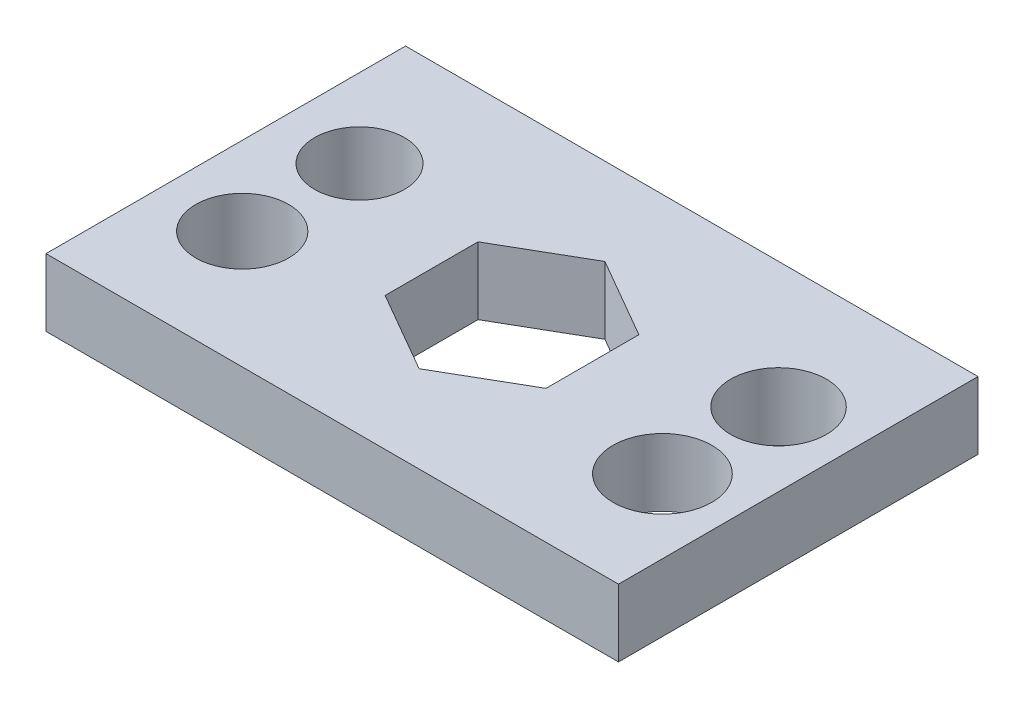
ISO-10303-21;
HEADER;
FILE_DESCRIPTION(('STEP AP214'),'2;1');
FILE_NAME('part.step','',(''),(''),'','','');
FILE_SCHEMA(('AUTOMOTIVE_DESIGN { 1 0 10303 214 1 1 1 1 }'));
ENDSEC;
DATA;
#1=APPLICATION_CONTEXT('core data for automotive mechanical design processes');
#2=APPLICATION_PROTOCOL_DEFINITION('international standard','automotive_design',2000,#1);
#3=PRODUCT_CONTEXT('',#1,'mechanical');
#4=PRODUCT('Part','Part','',(#3));
#5=PRODUCT_RELATED_PRODUCT_CATEGORY('part','',(#4));
#6=PRODUCT_DEFINITION_FORMATION('','',#4);
#7=PRODUCT_DEFINITION_CONTEXT('part definition',#1,'design');
#8=PRODUCT_DEFINITION('design','',#6,#7);
#9=PRODUCT_DEFINITION_SHAPE('','',#8);
#10=(LENGTH_UNIT() NAMED_UNIT(*) SI_UNIT(.MILLI.,.METRE.));
#11=(NAMED_UNIT(*) PLANE_ANGLE_UNIT() SI_UNIT($,.RADIAN.));
#12=(NAMED_UNIT(*) SI_UNIT($,.STERADIAN.) SOLID_ANGLE_UNIT());
#13=UNCERTAINTY_MEASURE_WITH_UNIT(LENGTH_MEASURE(1.E-05),#10,'distance_accuracy_value','');
#14=(GEOMETRIC_REPRESENTATION_CONTEXT(3) GLOBAL_UNCERTAINTY_ASSIGNED_CONTEXT((#13)) GLOBAL_UNIT_ASSIGNED_CONTEXT((#10,
#11,#12)) REPRESENTATION_CONTEXT('',''));
#15=CARTESIAN_POINT('',(0.,0.,0.));
#16=DIRECTION('',(0.,0.,1.));
#17=DIRECTION('',(1.,0.,0.));
#18=AXIS2_PLACEMENT_3D('',#15,#16,#17);
#19=CARTESIAN_POINT('',(0.,2.25,0.));
#20=DIRECTION('',(0.,-1.,0.));
#21=DIRECTION('',(0.,0.,-1.));
#22=AXIS2_PLACEMENT_3D('',#19,#20,#21);
#23=PLANE('',#22);
#24=DIRECTION('',(0.,0.,-1.));
#25=VECTOR('',#24,1.);
#26=CARTESIAN_POINT('',(9.55341392062965,2.25,6.));
#27=LINE('',#26,#25);
#28=CARTESIAN_POINT('',(9.55341392062965,2.25,6.));
#29=VERTEX_POINT('',#28);
#30=CARTESIAN_POINT('',(9.55341392062965,2.25,-6.));
#31=VERTEX_POINT('',#30);
#32=EDGE_CURVE('E168',#29,#31,#27,.T.);
#33=ORIENTED_EDGE('',*,*,#32,.T.);
#34=DIRECTION('',(-1.,0.,0.));
#35=VECTOR('',#34,1.);
#36=CARTESIAN_POINT('',(-9.55341392062965,2.25,-6.));
#37=LINE('',#36,#35);
#38=CARTESIAN_POINT('',(-9.55341392062965,2.25,-6.));
#39=VERTEX_POINT('',#38);
#40=EDGE_CURVE('E171',#31,#39,#37,.T.);
#41=ORIENTED_EDGE('',*,*,#40,.T.);
#42=DIRECTION('',(0.,0.,1.));
#43=VECTOR('',#42,1.);
#44=CARTESIAN_POINT('',(-9.55341392062965,2.25,6.));
#45=LINE('',#44,#43);
#46=CARTESIAN_POINT('',(-9.55341392062965,2.25,6.));
#47=VERTEX_POINT('',#46);
#48=EDGE_CURVE('E174',#39,#47,#45,.T.);
#49=ORIENTED_EDGE('',*,*,#48,.T.);
#50=DIRECTION('',(1.,0.,0.));
#51=VECTOR('',#50,1.);
#52=CARTESIAN_POINT('',(-9.55341392062965,2.25,6.));
#53=LINE('',#52,#51);
#54=EDGE_CURVE('E176',#47,#29,#53,.T.);
#55=ORIENTED_EDGE('',*,*,#54,.T.);
#56=EDGE_LOOP('',(#33,#41,#49,#55));
#57=FACE_BOUND('',#56,.T.);
#58=DIRECTION('',(0.,0.,-1.));
#59=VECTOR('',#58,1.);
#60=CARTESIAN_POINT('',(2.685,2.25,1.55018547277415));
#61=LINE('',#60,#59);
#62=CARTESIAN_POINT('',(2.685,2.25,1.55018547277415));
#63=VERTEX_POINT('',#62);
#64=CARTESIAN_POINT('',(2.685,2.25,-1.55018547277415));
#65=VERTEX_POINT('',#64);
#66=EDGE_CURVE('E114',#63,#65,#61,.T.);
#67=ORIENTED_EDGE('',*,*,#66,.F.);
#68=DIRECTION('',(0.866025403784439,0.,-0.5));
#69=VECTOR('',#68,1.);
#70=CARTESIAN_POINT('',(0.,2.25,3.10037094554829));
#71=LINE('',#70,#69);
#72=CARTESIAN_POINT('',(0.,2.25,3.10037094554829));
#73=VERTEX_POINT('',#72);
#74=EDGE_CURVE('E145',#73,#63,#71,.T.);
#75=ORIENTED_EDGE('',*,*,#74,.F.);
#76=DIRECTION('',(0.866025403784439,0.,0.5));
#77=VECTOR('',#76,1.);
#78=CARTESIAN_POINT('',(-2.685,2.25,1.55018547277414));
#79=LINE('',#78,#77);
#80=CARTESIAN_POINT('',(-2.685,2.25,1.55018547277414));
#81=VERTEX_POINT('',#80);
#82=EDGE_CURVE('E143',#81,#73,#79,.T.);
#83=ORIENTED_EDGE('',*,*,#82,.F.);
#84=DIRECTION('',(0.,0.,1.));
#85=VECTOR('',#84,1.);
#86=CARTESIAN_POINT('',(-2.685,2.25,-1.55018547277415));
#87=LINE('',#86,#85);
#88=CARTESIAN_POINT('',(-2.685,2.25,-1.55018547277415));
#89=VERTEX_POINT('',#88);
#90=EDGE_CURVE('E138',#89,#81,#87,.T.);
#91=ORIENTED_EDGE('',*,*,#90,.F.);
#92=DIRECTION('',(-0.866025403784439,0.,0.5));
#93=VECTOR('',#92,1.);
#94=CARTESIAN_POINT('',(0.,2.25,-3.10037094554829));
#95=LINE('',#94,#93);
#96=CARTESIAN_POINT('',(0.,2.25,-3.10037094554829));
#97=VERTEX_POINT('',#96);
#98=EDGE_CURVE('E136',#97,#89,#95,.T.);
#99=ORIENTED_EDGE('',*,*,#98,.F.);
#100=DIRECTION('',(-0.866025403784438,0.,-0.5));
#101=VECTOR('',#100,1.);
#102=CARTESIAN_POINT('',(2.685,2.25,-1.55018547277415));
#103=LINE('',#102,#101);
#104=EDGE_CURVE('E122',#65,#97,#103,.T.);
#105=ORIENTED_EDGE('',*,*,#104,.F.);
#106=EDGE_LOOP('',(#67,#75,#83,#91,#99,#105));
#107=FACE_BOUND('',#106,.T.);
#108=CARTESIAN_POINT('',(-6.92575523116967,2.25,-1.836983108));
#109=DIRECTION('',(0.,1.,0.));
#110=DIRECTION('',(0.,0.,1.));
#111=AXIS2_PLACEMENT_3D('',#108,#109,#110);
#112=CIRCLE('',#111,1.5);
#113=CARTESIAN_POINT('',(-6.92575523116967,2.25,-0.336983108000004));
#114=VERTEX_POINT('',#113);
#115=EDGE_CURVE('E148',#114,#114,#112,.T.);
#116=ORIENTED_EDGE('',*,*,#115,.F.);
#117=EDGE_LOOP('',(#116));
#118=FACE_BOUND('',#117,.T.);
#119=CARTESIAN_POINT('',(7.09887872713484,2.25,-1.79730386713403));
#120=DIRECTION('',(0.,1.,0.));
#121=DIRECTION('',(0.,0.,1.));
#122=AXIS2_PLACEMENT_3D('',#119,#120,#121);
#123=CIRCLE('',#122,1.6);
#124=CARTESIAN_POINT('',(7.09887872713484,2.25,-0.197303867134024));
#125=VERTEX_POINT('',#124);
#126=EDGE_CURVE('E288',#125,#125,#123,.T.);
#127=ORIENTED_EDGE('',*,*,#126,.F.);
#128=EDGE_LOOP('',(#127));
#129=FACE_BOUND('',#128,.T.);
#130=CARTESIAN_POINT('',(7.09887872713484,2.25,2.07793010147465));
#131=DIRECTION('',(0.,1.,0.));
#132=DIRECTION('',(0.,0.,1.));
#133=AXIS2_PLACEMENT_3D('',#130,#131,#132);
#134=CIRCLE('',#133,1.65);
#135=CARTESIAN_POINT('',(7.09887872713484,2.25,3.72793010147465));
#136=VERTEX_POINT('',#135);
#137=EDGE_CURVE('E282',#136,#136,#134,.T.);
#138=ORIENTED_EDGE('',*,*,#137,.F.);
#139=EDGE_LOOP('',(#138));
#140=FACE_BOUND('',#139,.T.);
#141=CARTESIAN_POINT('',(-6.92575523116967,2.25,2.07793010147465));
#142=DIRECTION('',(0.,1.,0.));
#143=DIRECTION('',(0.,0.,1.));
#144=AXIS2_PLACEMENT_3D('',#141,#142,#143);
#145=CIRCLE('',#144,1.55);
#146=CARTESIAN_POINT('',(-6.92575523116967,2.25,3.62793010147465));
#147=VERTEX_POINT('',#146);
#148=EDGE_CURVE('E273',#147,#147,#145,.T.);
#149=ORIENTED_EDGE('',*,*,#148,.F.);
#150=EDGE_LOOP('',(#149));
#151=FACE_BOUND('',#150,.T.);
#152=ADVANCED_FACE('F37',(#57,#107,#118,#129,#140,#151),#23,.F.);
#153=CARTESIAN_POINT('',(0.,0.,0.));
#154=DIRECTION('',(0.,-1.,0.));
#155=DIRECTION('',(0.,0.,-1.));
#156=AXIS2_PLACEMENT_3D('',#153,#154,#155);
#157=PLANE('',#156);
#158=CARTESIAN_POINT('',(7.09887872713484,0.,2.07793010147465));
#159=DIRECTION('',(0.,1.,0.));
#160=DIRECTION('',(0.,0.,1.));
#161=AXIS2_PLACEMENT_3D('',#158,#159,#160);
#162=CIRCLE('',#161,1.65);
#163=CARTESIAN_POINT('',(7.09887872713484,0.,3.72793010147465));
#164=VERTEX_POINT('',#163);
#165=EDGE_CURVE('E279',#164,#164,#162,.T.);
#166=ORIENTED_EDGE('',*,*,#165,.T.);
#167=EDGE_LOOP('',(#166));
#168=FACE_BOUND('',#167,.T.);
#169=CARTESIAN_POINT('',(-6.92575523116967,0.,-1.836983108));
#170=DIRECTION('',(0.,1.,0.));
#171=DIRECTION('',(0.,0.,1.));
#172=AXIS2_PLACEMENT_3D('',#169,#170,#171);
#173=CIRCLE('',#172,1.5);
#174=CARTESIAN_POINT('',(-6.92575523116967,0.,-0.336983108000004));
#175=VERTEX_POINT('',#174);
#176=EDGE_CURVE('E291',#175,#175,#173,.T.);
#177=ORIENTED_EDGE('',*,*,#176,.T.);
#178=EDGE_LOOP('',(#177));
#179=FACE_BOUND('',#178,.T.);
#180=DIRECTION('',(0.,0.,-1.));
#181=VECTOR('',#180,1.);
#182=CARTESIAN_POINT('',(9.55341392062965,0.,6.));
#183=LINE('',#182,#181);
#184=CARTESIAN_POINT('',(9.55341392062965,0.,6.));
#185=VERTEX_POINT('',#184);
#186=CARTESIAN_POINT('',(9.55341392062965,0.,-6.));
#187=VERTEX_POINT('',#186);
#188=EDGE_CURVE('E130',#185,#187,#183,.T.);
#189=ORIENTED_EDGE('',*,*,#188,.F.);
#190=DIRECTION('',(1.,0.,0.));
#191=VECTOR('',#190,1.);
#192=CARTESIAN_POINT('',(-9.55341392062965,0.,6.));
#193=LINE('',#192,#191);
#194=CARTESIAN_POINT('',(-9.55341392062965,0.,6.));
#195=VERTEX_POINT('',#194);
#196=EDGE_CURVE('E172',#195,#185,#193,.T.);
#197=ORIENTED_EDGE('',*,*,#196,.F.);
#198=DIRECTION('',(0.,0.,1.));
#199=VECTOR('',#198,1.);
#200=CARTESIAN_POINT('',(-9.55341392062965,0.,6.));
#201=LINE('',#200,#199);
#202=CARTESIAN_POINT('',(-9.55341392062965,0.,-6.));
#203=VERTEX_POINT('',#202);
#204=EDGE_CURVE('E183',#203,#195,#201,.T.);
#205=ORIENTED_EDGE('',*,*,#204,.F.);
#206=DIRECTION('',(-1.,0.,0.));
#207=VECTOR('',#206,1.);
#208=CARTESIAN_POINT('',(-9.55341392062965,0.,-6.));
#209=LINE('',#208,#207);
#210=EDGE_CURVE('E181',#187,#203,#209,.T.);
#211=ORIENTED_EDGE('',*,*,#210,.F.);
#212=EDGE_LOOP('',(#189,#197,#205,#211));
#213=FACE_BOUND('',#212,.T.);
#214=DIRECTION('',(0.866025403784439,0.,-0.5));
#215=VECTOR('',#214,1.);
#216=CARTESIAN_POINT('',(0.,0.,3.10037094554829));
#217=LINE('',#216,#215);
#218=CARTESIAN_POINT('',(0.,0.,3.10037094554829));
#219=VERTEX_POINT('',#218);
#220=CARTESIAN_POINT('',(2.685,0.,1.55018547277415));
#221=VERTEX_POINT('',#220);
#222=EDGE_CURVE('E123',#219,#221,#217,.T.);
#223=ORIENTED_EDGE('',*,*,#222,.T.);
#224=DIRECTION('',(0.,0.,-1.));
#225=VECTOR('',#224,1.);
#226=CARTESIAN_POINT('',(2.685,0.,1.55018547277415));
#227=LINE('',#226,#225);
#228=CARTESIAN_POINT('',(2.685,0.,-1.55018547277415));
#229=VERTEX_POINT('',#228);
#230=EDGE_CURVE('E60',#221,#229,#227,.T.);
#231=ORIENTED_EDGE('',*,*,#230,.T.);
#232=DIRECTION('',(-0.866025403784438,0.,-0.5));
#233=VECTOR('',#232,1.);
#234=CARTESIAN_POINT('',(2.685,0.,-1.55018547277415));
#235=LINE('',#234,#233);
#236=CARTESIAN_POINT('',(0.,0.,-3.10037094554829));
#237=VERTEX_POINT('',#236);
#238=EDGE_CURVE('E129',#229,#237,#235,.T.);
#239=ORIENTED_EDGE('',*,*,#238,.T.);
#240=DIRECTION('',(-0.866025403784439,0.,0.5));
#241=VECTOR('',#240,1.);
#242=CARTESIAN_POINT('',(0.,0.,-3.10037094554829));
#243=LINE('',#242,#241);
#244=CARTESIAN_POINT('',(-2.685,0.,-1.55018547277415));
#245=VERTEX_POINT('',#244);
#246=EDGE_CURVE('E150',#237,#245,#243,.T.);
#247=ORIENTED_EDGE('',*,*,#246,.T.);
#248=DIRECTION('',(0.,0.,1.));
#249=VECTOR('',#248,1.);
#250=CARTESIAN_POINT('',(-2.685,0.,-1.55018547277415));
#251=LINE('',#250,#249);
#252=CARTESIAN_POINT('',(-2.685,0.,1.55018547277414));
#253=VERTEX_POINT('',#252);
#254=EDGE_CURVE('E153',#245,#253,#251,.T.);
#255=ORIENTED_EDGE('',*,*,#254,.T.);
#256=DIRECTION('',(0.866025403784439,0.,0.5));
#257=VECTOR('',#256,1.);
#258=CARTESIAN_POINT('',(-2.685,0.,1.55018547277414));
#259=LINE('',#258,#257);
#260=EDGE_CURVE('E156',#253,#219,#259,.T.);
#261=ORIENTED_EDGE('',*,*,#260,.T.);
#262=EDGE_LOOP('',(#223,#231,#239,#247,#255,#261));
#263=FACE_BOUND('',#262,.T.);
#264=CARTESIAN_POINT('',(7.09887872713484,0.,-1.79730386713403));
#265=DIRECTION('',(0.,1.,0.));
#266=DIRECTION('',(0.,0.,1.));
#267=AXIS2_PLACEMENT_3D('',#264,#265,#266);
#268=CIRCLE('',#267,1.6);
#269=CARTESIAN_POINT('',(7.09887872713484,0.,-0.197303867134024));
#270=VERTEX_POINT('',#269);
#271=EDGE_CURVE('E285',#270,#270,#268,.T.);
#272=ORIENTED_EDGE('',*,*,#271,.T.);
#273=EDGE_LOOP('',(#272));
#274=FACE_BOUND('',#273,.T.);
#275=CARTESIAN_POINT('',(-6.92575523116967,0.,2.07793010147465));
#276=DIRECTION('',(0.,1.,0.));
#277=DIRECTION('',(0.,0.,1.));
#278=AXIS2_PLACEMENT_3D('',#275,#276,#277);
#279=CIRCLE('',#278,1.55);
#280=CARTESIAN_POINT('',(-6.92575523116967,0.,3.62793010147465));
#281=VERTEX_POINT('',#280);
#282=EDGE_CURVE('E276',#281,#281,#279,.T.);
#283=ORIENTED_EDGE('',*,*,#282,.T.);
#284=EDGE_LOOP('',(#283));
#285=FACE_BOUND('',#284,.T.);
#286=ADVANCED_FACE('F201',(#168,#179,#213,#263,#274,#285),#157,.T.);
#287=CARTESIAN_POINT('',(9.55341392062965,2.25,6.));
#288=DIRECTION('',(-1.,0.,0.));
#289=DIRECTION('',(0.,0.,1.));
#290=AXIS2_PLACEMENT_3D('',#287,#288,#289);
#291=PLANE('',#290);
#292=ORIENTED_EDGE('',*,*,#188,.T.);
#293=DIRECTION('',(0.,-1.,0.));
#294=VECTOR('',#293,1.);
#295=CARTESIAN_POINT('',(9.55341392062965,2.25,-6.));
#296=LINE('',#295,#294);
#297=EDGE_CURVE('E11',#31,#187,#296,.T.);
#298=ORIENTED_EDGE('',*,*,#297,.F.);
#299=ORIENTED_EDGE('',*,*,#32,.F.);
#300=DIRECTION('',(0.,-1.,0.));
#301=VECTOR('',#300,1.);
#302=CARTESIAN_POINT('',(9.55341392062965,2.25,6.));
#303=LINE('',#302,#301);
#304=EDGE_CURVE('E178',#29,#185,#303,.T.);
#305=ORIENTED_EDGE('',*,*,#304,.T.);
#306=EDGE_LOOP('',(#292,#298,#299,#305));
#307=FACE_BOUND('',#306,.T.);
#308=ADVANCED_FACE('F39',(#307),#291,.F.);
#309=CARTESIAN_POINT('',(-9.55341392062965,2.25,-6.));
#310=DIRECTION('',(0.,0.,1.));
#311=DIRECTION('',(1.,0.,0.));
#312=AXIS2_PLACEMENT_3D('',#309,#310,#311);
#313=PLANE('',#312);
#314=ORIENTED_EDGE('',*,*,#210,.T.);
#315=DIRECTION('',(0.,-1.,0.));
#316=VECTOR('',#315,1.);
#317=CARTESIAN_POINT('',(-9.55341392062965,2.25,-6.));
#318=LINE('',#317,#316);
#319=EDGE_CURVE('E45',#39,#203,#318,.T.);
#320=ORIENTED_EDGE('',*,*,#319,.F.);
#321=ORIENTED_EDGE('',*,*,#40,.F.);
#322=ORIENTED_EDGE('',*,*,#297,.T.);
#323=EDGE_LOOP('',(#314,#320,#321,#322));
#324=FACE_BOUND('',#323,.T.);
#325=ADVANCED_FACE('F211',(#324),#313,.F.);
#326=CARTESIAN_POINT('',(-9.55341392062965,2.25,6.));
#327=DIRECTION('',(1.,0.,0.));
#328=DIRECTION('',(0.,0.,-1.));
#329=AXIS2_PLACEMENT_3D('',#326,#327,#328);
#330=PLANE('',#329);
#331=ORIENTED_EDGE('',*,*,#204,.T.);
#332=DIRECTION('',(0.,-1.,0.));
#333=VECTOR('',#332,1.);
#334=CARTESIAN_POINT('',(-9.55341392062965,2.25,6.));
#335=LINE('',#334,#333);
#336=EDGE_CURVE('E188',#47,#195,#335,.T.);
#337=ORIENTED_EDGE('',*,*,#336,.F.);
#338=ORIENTED_EDGE('',*,*,#48,.F.);
#339=ORIENTED_EDGE('',*,*,#319,.T.);
#340=EDGE_LOOP('',(#331,#337,#338,#339));
#341=FACE_BOUND('',#340,.T.);
#342=ADVANCED_FACE('F195',(#341),#330,.F.);
#343=CARTESIAN_POINT('',(-9.55341392062965,2.25,6.));
#344=DIRECTION('',(0.,0.,-1.));
#345=DIRECTION('',(-1.,0.,0.));
#346=AXIS2_PLACEMENT_3D('',#343,#344,#345);
#347=PLANE('',#346);
#348=ORIENTED_EDGE('',*,*,#196,.T.);
#349=ORIENTED_EDGE('',*,*,#304,.F.);
#350=ORIENTED_EDGE('',*,*,#54,.F.);
#351=ORIENTED_EDGE('',*,*,#336,.T.);
#352=EDGE_LOOP('',(#348,#349,#350,#351));
#353=FACE_BOUND('',#352,.T.);
#354=ADVANCED_FACE('F205',(#353),#347,.F.);
#355=CARTESIAN_POINT('',(2.685,2.25,1.55018547277415));
#356=DIRECTION('',(-1.,0.,0.));
#357=DIRECTION('',(0.,0.,1.));
#358=AXIS2_PLACEMENT_3D('',#355,#356,#357);
#359=PLANE('',#358);
#360=ORIENTED_EDGE('',*,*,#230,.F.);
#361=DIRECTION('',(0.,-1.,0.));
#362=VECTOR('',#361,1.);
#363=CARTESIAN_POINT('',(2.685,2.25,1.55018547277415));
#364=LINE('',#363,#362);
#365=EDGE_CURVE('E118',#63,#221,#364,.T.);
#366=ORIENTED_EDGE('',*,*,#365,.F.);
#367=ORIENTED_EDGE('',*,*,#66,.T.);
#368=DIRECTION('',(0.,-1.,0.));
#369=VECTOR('',#368,1.);
#370=CARTESIAN_POINT('',(2.685,2.25,-1.55018547277415));
#371=LINE('',#370,#369);
#372=EDGE_CURVE('E117',#65,#229,#371,.T.);
#373=ORIENTED_EDGE('',*,*,#372,.T.);
#374=EDGE_LOOP('',(#360,#366,#367,#373));
#375=FACE_BOUND('',#374,.T.);
#376=ADVANCED_FACE('F116',(#375),#359,.T.);
#377=CARTESIAN_POINT('',(2.685,2.25,-1.55018547277415));
#378=DIRECTION('',(-0.5,0.,0.866025403784438));
#379=DIRECTION('',(0.866025403784439,0.,0.5));
#380=AXIS2_PLACEMENT_3D('',#377,#378,#379);
#381=PLANE('',#380);
#382=ORIENTED_EDGE('',*,*,#238,.F.);
#383=ORIENTED_EDGE('',*,*,#372,.F.);
#384=ORIENTED_EDGE('',*,*,#104,.T.);
#385=DIRECTION('',(0.,-1.,0.));
#386=VECTOR('',#385,1.);
#387=CARTESIAN_POINT('',(0.,2.25,-3.10037094554829));
#388=LINE('',#387,#386);
#389=EDGE_CURVE('E131',#97,#237,#388,.T.);
#390=ORIENTED_EDGE('',*,*,#389,.T.);
#391=EDGE_LOOP('',(#382,#383,#384,#390));
#392=FACE_BOUND('',#391,.T.);
#393=ADVANCED_FACE('F126',(#392),#381,.T.);
#394=CARTESIAN_POINT('',(0.,2.25,-3.10037094554829));
#395=DIRECTION('',(0.5,0.,0.866025403784439));
#396=DIRECTION('',(0.866025403784439,0.,-0.5));
#397=AXIS2_PLACEMENT_3D('',#394,#395,#396);
#398=PLANE('',#397);
#399=ORIENTED_EDGE('',*,*,#246,.F.);
#400=ORIENTED_EDGE('',*,*,#389,.F.);
#401=ORIENTED_EDGE('',*,*,#98,.T.);
#402=DIRECTION('',(0.,-1.,0.));
#403=VECTOR('',#402,1.);
#404=CARTESIAN_POINT('',(-2.685,2.25,-1.55018547277415));
#405=LINE('',#404,#403);
#406=EDGE_CURVE('E165',#89,#245,#405,.T.);
#407=ORIENTED_EDGE('',*,*,#406,.T.);
#408=EDGE_LOOP('',(#399,#400,#401,#407));
#409=FACE_BOUND('',#408,.T.);
#410=ADVANCED_FACE('F235',(#409),#398,.T.);
#411=CARTESIAN_POINT('',(-2.685,2.25,-1.55018547277415));
#412=DIRECTION('',(1.,0.,0.));
#413=DIRECTION('',(0.,0.,-1.));
#414=AXIS2_PLACEMENT_3D('',#411,#412,#413);
#415=PLANE('',#414);
#416=ORIENTED_EDGE('',*,*,#254,.F.);
#417=ORIENTED_EDGE('',*,*,#406,.F.);
#418=ORIENTED_EDGE('',*,*,#90,.T.);
#419=DIRECTION('',(0.,-1.,0.));
#420=VECTOR('',#419,1.);
#421=CARTESIAN_POINT('',(-2.685,2.25,1.55018547277414));
#422=LINE('',#421,#420);
#423=EDGE_CURVE('E163',#81,#253,#422,.T.);
#424=ORIENTED_EDGE('',*,*,#423,.T.);
#425=EDGE_LOOP('',(#416,#417,#418,#424));
#426=FACE_BOUND('',#425,.T.);
#427=ADVANCED_FACE('F239',(#426),#415,.T.);
#428=CARTESIAN_POINT('',(-2.685,2.25,1.55018547277414));
#429=DIRECTION('',(0.5,0.,-0.866025403784439));
#430=DIRECTION('',(-0.866025403784439,0.,-0.5));
#431=AXIS2_PLACEMENT_3D('',#428,#429,#430);
#432=PLANE('',#431);
#433=ORIENTED_EDGE('',*,*,#260,.F.);
#434=ORIENTED_EDGE('',*,*,#423,.F.);
#435=ORIENTED_EDGE('',*,*,#82,.T.);
#436=DIRECTION('',(0.,-1.,0.));
#437=VECTOR('',#436,1.);
#438=CARTESIAN_POINT('',(0.,2.25,3.10037094554829));
#439=LINE('',#438,#437);
#440=EDGE_CURVE('E52',#73,#219,#439,.T.);
#441=ORIENTED_EDGE('',*,*,#440,.T.);
#442=EDGE_LOOP('',(#433,#434,#435,#441));
#443=FACE_BOUND('',#442,.T.);
#444=ADVANCED_FACE('F245',(#443),#432,.T.);
#445=CARTESIAN_POINT('',(0.,2.25,3.10037094554829));
#446=DIRECTION('',(-0.5,0.,-0.866025403784439));
#447=DIRECTION('',(-0.866025403784439,0.,0.5));
#448=AXIS2_PLACEMENT_3D('',#445,#446,#447);
#449=PLANE('',#448);
#450=ORIENTED_EDGE('',*,*,#222,.F.);
#451=ORIENTED_EDGE('',*,*,#440,.F.);
#452=ORIENTED_EDGE('',*,*,#74,.T.);
#453=ORIENTED_EDGE('',*,*,#365,.T.);
#454=EDGE_LOOP('',(#450,#451,#452,#453));
#455=FACE_BOUND('',#454,.T.);
#456=ADVANCED_FACE('F249',(#455),#449,.T.);
#457=CARTESIAN_POINT('',(-6.92575523116967,2.25,-1.836983108));
#458=DIRECTION('',(0.,-1.,0.));
#459=DIRECTION('',(0.,0.,-1.));
#460=AXIS2_PLACEMENT_3D('',#457,#458,#459);
#461=CYLINDRICAL_SURFACE('',#460,1.5);
#462=ORIENTED_EDGE('',*,*,#115,.T.);
#463=EDGE_LOOP('',(#462));
#464=FACE_BOUND('',#463,.T.);
#465=ORIENTED_EDGE('',*,*,#176,.F.);
#466=EDGE_LOOP('',(#465));
#467=FACE_BOUND('',#466,.T.);
#468=ADVANCED_FACE('F253',(#464,#467),#461,.F.);
#469=CARTESIAN_POINT('',(7.09887872713484,2.25,-1.79730386713403));
#470=DIRECTION('',(0.,-1.,0.));
#471=DIRECTION('',(0.,0.,-1.));
#472=AXIS2_PLACEMENT_3D('',#469,#470,#471);
#473=CYLINDRICAL_SURFACE('',#472,1.6);
#474=ORIENTED_EDGE('',*,*,#126,.T.);
#475=EDGE_LOOP('',(#474));
#476=FACE_BOUND('',#475,.T.);
#477=ORIENTED_EDGE('',*,*,#271,.F.);
#478=EDGE_LOOP('',(#477));
#479=FACE_BOUND('',#478,.T.);
#480=ADVANCED_FACE('F256',(#476,#479),#473,.F.);
#481=CARTESIAN_POINT('',(7.09887872713484,2.25,2.07793010147465));
#482=DIRECTION('',(0.,-1.,0.));
#483=DIRECTION('',(0.,0.,-1.));
#484=AXIS2_PLACEMENT_3D('',#481,#482,#483);
#485=CYLINDRICAL_SURFACE('',#484,1.65);
#486=ORIENTED_EDGE('',*,*,#137,.T.);
#487=EDGE_LOOP('',(#486));
#488=FACE_BOUND('',#487,.T.);
#489=ORIENTED_EDGE('',*,*,#165,.F.);
#490=EDGE_LOOP('',(#489));
#491=FACE_BOUND('',#490,.T.);
#492=ADVANCED_FACE('F260',(#488,#491),#485,.F.);
#493=CARTESIAN_POINT('',(-6.92575523116967,2.25,2.07793010147465));
#494=DIRECTION('',(0.,-1.,0.));
#495=DIRECTION('',(0.,0.,-1.));
#496=AXIS2_PLACEMENT_3D('',#493,#494,#495);
#497=CYLINDRICAL_SURFACE('',#496,1.55);
#498=ORIENTED_EDGE('',*,*,#148,.T.);
#499=EDGE_LOOP('',(#498));
#500=FACE_BOUND('',#499,.T.);
#501=ORIENTED_EDGE('',*,*,#282,.F.);
#502=EDGE_LOOP('',(#501));
#503=FACE_BOUND('',#502,.T.);
#504=ADVANCED_FACE('F264',(#500,#503),#497,.F.);
#505=CLOSED_SHELL('',(#152,#286,#308,#325,#342,#354,#376,#393,#410,#427,#444,#456,#468,#480,
#492,#504));
#506=MANIFOLD_SOLID_BREP('B2',#505);
#507=ADVANCED_BREP_SHAPE_REPRESENTATION('',(#18,#506),#14);
#508=SHAPE_DEFINITION_REPRESENTATION(#9,#507);
ENDSEC;
END-ISO-10303-21;
